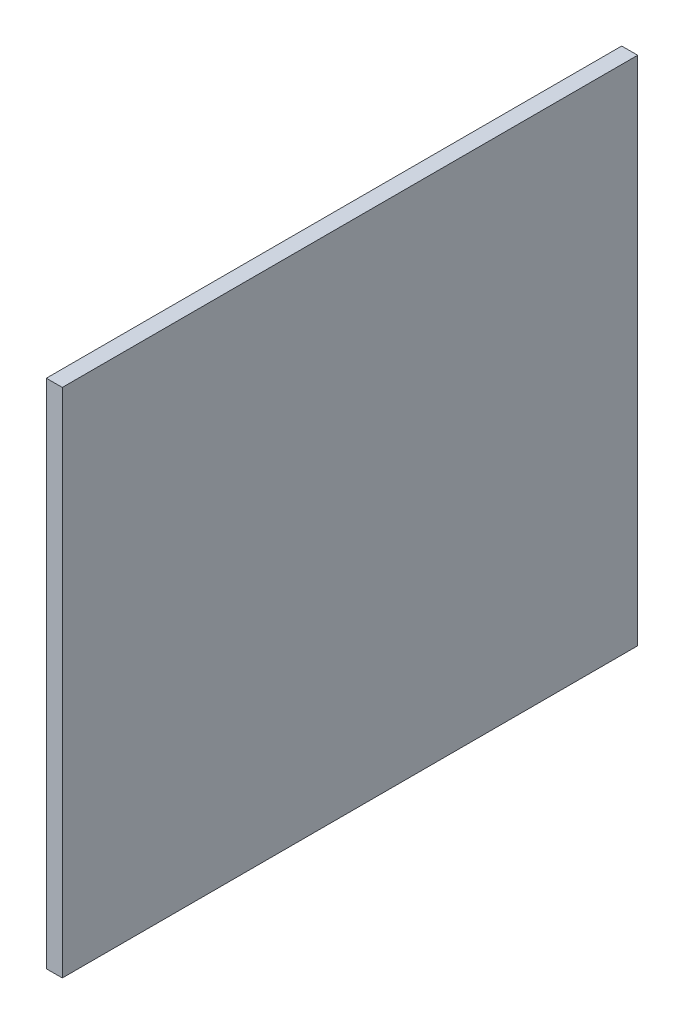
ISO-10303-21;
HEADER;
FILE_DESCRIPTION(('STEP AP214'),'2;1');
FILE_NAME('part.step','',(''),(''),'','','');
FILE_SCHEMA(('AUTOMOTIVE_DESIGN { 1 0 10303 214 1 1 1 1 }'));
ENDSEC;
DATA;
#1=APPLICATION_CONTEXT('core data for automotive mechanical design processes');
#2=APPLICATION_PROTOCOL_DEFINITION('international standard','automotive_design',2000,#1);
#3=PRODUCT_CONTEXT('',#1,'mechanical');
#4=PRODUCT('Part','Part','',(#3));
#5=PRODUCT_RELATED_PRODUCT_CATEGORY('part','',(#4));
#6=PRODUCT_DEFINITION_FORMATION('','',#4);
#7=PRODUCT_DEFINITION_CONTEXT('part definition',#1,'design');
#8=PRODUCT_DEFINITION('design','',#6,#7);
#9=PRODUCT_DEFINITION_SHAPE('','',#8);
#10=(LENGTH_UNIT() NAMED_UNIT(*) SI_UNIT(.MILLI.,.METRE.));
#11=(NAMED_UNIT(*) PLANE_ANGLE_UNIT() SI_UNIT($,.RADIAN.));
#12=(NAMED_UNIT(*) SI_UNIT($,.STERADIAN.) SOLID_ANGLE_UNIT());
#13=UNCERTAINTY_MEASURE_WITH_UNIT(LENGTH_MEASURE(1.E-05),#10,'distance_accuracy_value','');
#14=(GEOMETRIC_REPRESENTATION_CONTEXT(3) GLOBAL_UNCERTAINTY_ASSIGNED_CONTEXT((#13)) GLOBAL_UNIT_ASSIGNED_CONTEXT((#10,
#11,#12)) REPRESENTATION_CONTEXT('',''));
#15=CARTESIAN_POINT('',(0.,0.,0.));
#16=DIRECTION('',(0.,0.,1.));
#17=DIRECTION('',(1.,0.,0.));
#18=AXIS2_PLACEMENT_3D('',#15,#16,#17);
#19=CARTESIAN_POINT('',(6.35,101.6,114.3));
#20=DIRECTION('',(0.,0.,-1.));
#21=DIRECTION('',(0.,1.,0.));
#22=AXIS2_PLACEMENT_3D('',#19,#20,#21);
#23=PLANE('',#22);
#24=DIRECTION('',(0.,-1.,0.));
#25=VECTOR('',#24,1.);
#26=CARTESIAN_POINT('',(0.,101.6,114.3));
#27=LINE('',#26,#25);
#28=CARTESIAN_POINT('',(0.,101.6,114.3));
#29=VERTEX_POINT('',#28);
#30=CARTESIAN_POINT('',(0.,-101.6,114.3));
#31=VERTEX_POINT('',#30);
#32=EDGE_CURVE('E96',#29,#31,#27,.T.);
#33=ORIENTED_EDGE('',*,*,#32,.T.);
#34=DIRECTION('',(-1.,0.,0.));
#35=VECTOR('',#34,1.);
#36=CARTESIAN_POINT('',(6.35,-101.6,114.3));
#37=LINE('',#36,#35);
#38=CARTESIAN_POINT('',(6.35,-101.6,114.3));
#39=VERTEX_POINT('',#38);
#40=EDGE_CURVE('E11',#39,#31,#37,.T.);
#41=ORIENTED_EDGE('',*,*,#40,.F.);
#42=DIRECTION('',(0.,-1.,0.));
#43=VECTOR('',#42,1.);
#44=CARTESIAN_POINT('',(6.35,101.6,114.3));
#45=LINE('',#44,#43);
#46=CARTESIAN_POINT('',(6.35,101.6,114.3));
#47=VERTEX_POINT('',#46);
#48=EDGE_CURVE('E84',#47,#39,#45,.T.);
#49=ORIENTED_EDGE('',*,*,#48,.F.);
#50=DIRECTION('',(-1.,0.,0.));
#51=VECTOR('',#50,1.);
#52=CARTESIAN_POINT('',(6.35,101.6,114.3));
#53=LINE('',#52,#51);
#54=EDGE_CURVE('E92',#47,#29,#53,.T.);
#55=ORIENTED_EDGE('',*,*,#54,.T.);
#56=EDGE_LOOP('',(#33,#41,#49,#55));
#57=FACE_BOUND('',#56,.T.);
#58=ADVANCED_FACE('F33',(#57),#23,.F.);
#59=CARTESIAN_POINT('',(6.35,-101.6,-114.3));
#60=DIRECTION('',(0.,1.,0.));
#61=DIRECTION('',(0.,0.,1.));
#62=AXIS2_PLACEMENT_3D('',#59,#60,#61);
#63=PLANE('',#62);
#64=DIRECTION('',(0.,0.,-1.));
#65=VECTOR('',#64,1.);
#66=CARTESIAN_POINT('',(0.,-101.6,-114.3));
#67=LINE('',#66,#65);
#68=CARTESIAN_POINT('',(0.,-101.6,-114.3));
#69=VERTEX_POINT('',#68);
#70=EDGE_CURVE('E88',#31,#69,#67,.T.);
#71=ORIENTED_EDGE('',*,*,#70,.T.);
#72=DIRECTION('',(-1.,0.,0.));
#73=VECTOR('',#72,1.);
#74=CARTESIAN_POINT('',(6.35,-101.6,-114.3));
#75=LINE('',#74,#73);
#76=CARTESIAN_POINT('',(6.35,-101.6,-114.3));
#77=VERTEX_POINT('',#76);
#78=EDGE_CURVE('E41',#77,#69,#75,.T.);
#79=ORIENTED_EDGE('',*,*,#78,.F.);
#80=DIRECTION('',(0.,0.,-1.));
#81=VECTOR('',#80,1.);
#82=CARTESIAN_POINT('',(6.35,-101.6,-114.3));
#83=LINE('',#82,#81);
#84=EDGE_CURVE('E79',#39,#77,#83,.T.);
#85=ORIENTED_EDGE('',*,*,#84,.F.);
#86=ORIENTED_EDGE('',*,*,#40,.T.);
#87=EDGE_LOOP('',(#71,#79,#85,#86));
#88=FACE_BOUND('',#87,.T.);
#89=ADVANCED_FACE('F87',(#88),#63,.F.);
#90=CARTESIAN_POINT('',(6.35,101.6,-114.3));
#91=DIRECTION('',(0.,0.,1.));
#92=DIRECTION('',(0.,-1.,0.));
#93=AXIS2_PLACEMENT_3D('',#90,#91,#92);
#94=PLANE('',#93);
#95=DIRECTION('',(0.,1.,0.));
#96=VECTOR('',#95,1.);
#97=CARTESIAN_POINT('',(0.,101.6,-114.3));
#98=LINE('',#97,#96);
#99=CARTESIAN_POINT('',(0.,101.6,-114.3));
#100=VERTEX_POINT('',#99);
#101=EDGE_CURVE('E66',#69,#100,#98,.T.);
#102=ORIENTED_EDGE('',*,*,#101,.T.);
#103=DIRECTION('',(-1.,0.,0.));
#104=VECTOR('',#103,1.);
#105=CARTESIAN_POINT('',(6.35,101.6,-114.3));
#106=LINE('',#105,#104);
#107=CARTESIAN_POINT('',(6.35,101.6,-114.3));
#108=VERTEX_POINT('',#107);
#109=EDGE_CURVE('E89',#108,#100,#106,.T.);
#110=ORIENTED_EDGE('',*,*,#109,.F.);
#111=DIRECTION('',(0.,1.,0.));
#112=VECTOR('',#111,1.);
#113=CARTESIAN_POINT('',(6.35,101.6,-114.3));
#114=LINE('',#113,#112);
#115=EDGE_CURVE('E82',#77,#108,#114,.T.);
#116=ORIENTED_EDGE('',*,*,#115,.F.);
#117=ORIENTED_EDGE('',*,*,#78,.T.);
#118=EDGE_LOOP('',(#102,#110,#116,#117));
#119=FACE_BOUND('',#118,.T.);
#120=ADVANCED_FACE('F90',(#119),#94,.F.);
#121=CARTESIAN_POINT('',(6.35,101.6,-114.3));
#122=DIRECTION('',(0.,-1.,0.));
#123=DIRECTION('',(0.,0.,-1.));
#124=AXIS2_PLACEMENT_3D('',#121,#122,#123);
#125=PLANE('',#124);
#126=DIRECTION('',(0.,0.,1.));
#127=VECTOR('',#126,1.);
#128=CARTESIAN_POINT('',(0.,101.6,-114.3));
#129=LINE('',#128,#127);
#130=EDGE_CURVE('E72',#100,#29,#129,.T.);
#131=ORIENTED_EDGE('',*,*,#130,.T.);
#132=ORIENTED_EDGE('',*,*,#54,.F.);
#133=DIRECTION('',(0.,0.,1.));
#134=VECTOR('',#133,1.);
#135=CARTESIAN_POINT('',(6.35,101.6,-114.3));
#136=LINE('',#135,#134);
#137=EDGE_CURVE('E49',#108,#47,#136,.T.);
#138=ORIENTED_EDGE('',*,*,#137,.F.);
#139=ORIENTED_EDGE('',*,*,#109,.T.);
#140=EDGE_LOOP('',(#131,#132,#138,#139));
#141=FACE_BOUND('',#140,.T.);
#142=ADVANCED_FACE('F103',(#141),#125,.F.);
#143=CARTESIAN_POINT('',(6.35,0.,0.));
#144=DIRECTION('',(-1.,0.,0.));
#145=DIRECTION('',(0.,0.,1.));
#146=AXIS2_PLACEMENT_3D('',#143,#144,#145);
#147=PLANE('',#146);
#148=ORIENTED_EDGE('',*,*,#48,.T.);
#149=ORIENTED_EDGE('',*,*,#84,.T.);
#150=ORIENTED_EDGE('',*,*,#115,.T.);
#151=ORIENTED_EDGE('',*,*,#137,.T.);
#152=EDGE_LOOP('',(#148,#149,#150,#151));
#153=FACE_BOUND('',#152,.T.);
#154=ADVANCED_FACE('F80',(#153),#147,.F.);
#155=CARTESIAN_POINT('',(0.,0.,0.));
#156=DIRECTION('',(-1.,0.,0.));
#157=DIRECTION('',(0.,0.,1.));
#158=AXIS2_PLACEMENT_3D('',#155,#156,#157);
#159=PLANE('',#158);
#160=ORIENTED_EDGE('',*,*,#32,.F.);
#161=ORIENTED_EDGE('',*,*,#130,.F.);
#162=ORIENTED_EDGE('',*,*,#101,.F.);
#163=ORIENTED_EDGE('',*,*,#70,.F.);
#164=EDGE_LOOP('',(#160,#161,#162,#163));
#165=FACE_BOUND('',#164,.T.);
#166=ADVANCED_FACE('F106',(#165),#159,.T.);
#167=CLOSED_SHELL('',(#58,#89,#120,#142,#154,#166));
#168=MANIFOLD_SOLID_BREP('B2',#167);
#169=ADVANCED_BREP_SHAPE_REPRESENTATION('',(#18,#168),#14);
#170=SHAPE_DEFINITION_REPRESENTATION(#9,#169);
ENDSEC;
END-ISO-10303-21;
